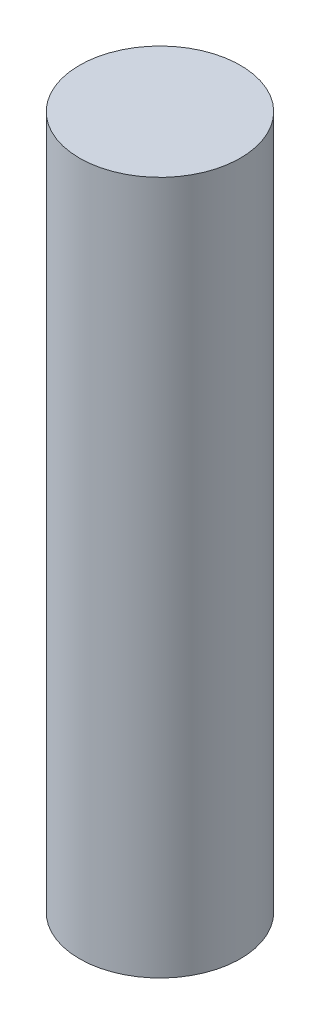
ISO-10303-21;
HEADER;
FILE_DESCRIPTION(('STEP AP214'),'2;1');
FILE_NAME('part.step','',(''),(''),'','','');
FILE_SCHEMA(('AUTOMOTIVE_DESIGN { 1 0 10303 214 1 1 1 1 }'));
ENDSEC;
DATA;
#1=APPLICATION_CONTEXT('core data for automotive mechanical design processes');
#2=APPLICATION_PROTOCOL_DEFINITION('international standard','automotive_design',2000,#1);
#3=PRODUCT_CONTEXT('',#1,'mechanical');
#4=PRODUCT('Part','Part','',(#3));
#5=PRODUCT_RELATED_PRODUCT_CATEGORY('part','',(#4));
#6=PRODUCT_DEFINITION_FORMATION('','',#4);
#7=PRODUCT_DEFINITION_CONTEXT('part definition',#1,'design');
#8=PRODUCT_DEFINITION('design','',#6,#7);
#9=PRODUCT_DEFINITION_SHAPE('','',#8);
#10=(LENGTH_UNIT() NAMED_UNIT(*) SI_UNIT(.MILLI.,.METRE.));
#11=(NAMED_UNIT(*) PLANE_ANGLE_UNIT() SI_UNIT($,.RADIAN.));
#12=(NAMED_UNIT(*) SI_UNIT($,.STERADIAN.) SOLID_ANGLE_UNIT());
#13=UNCERTAINTY_MEASURE_WITH_UNIT(LENGTH_MEASURE(1.E-05),#10,'distance_accuracy_value','');
#14=(GEOMETRIC_REPRESENTATION_CONTEXT(3) GLOBAL_UNCERTAINTY_ASSIGNED_CONTEXT((#13)) GLOBAL_UNIT_ASSIGNED_CONTEXT((#10,
#11,#12)) REPRESENTATION_CONTEXT('',''));
#15=CARTESIAN_POINT('',(0.,0.,0.));
#16=DIRECTION('',(0.,0.,1.));
#17=DIRECTION('',(1.,0.,0.));
#18=AXIS2_PLACEMENT_3D('',#15,#16,#17);
#19=CARTESIAN_POINT('',(0.,86.19,0.));
#20=DIRECTION('',(0.,-1.,0.));
#21=DIRECTION('',(0.,0.,-1.));
#22=AXIS2_PLACEMENT_3D('',#19,#20,#21);
#23=CYLINDRICAL_SURFACE('',#22,10.);
#24=CARTESIAN_POINT('',(0.,86.19,0.));
#25=DIRECTION('',(0.,1.,0.));
#26=DIRECTION('',(0.,0.,1.));
#27=AXIS2_PLACEMENT_3D('',#24,#25,#26);
#28=CIRCLE('',#27,10.);
#29=CARTESIAN_POINT('',(0.,86.19,10.));
#30=VERTEX_POINT('',#29);
#31=EDGE_CURVE('E10',#30,#30,#28,.T.);
#32=ORIENTED_EDGE('',*,*,#31,.F.);
#33=EDGE_LOOP('',(#32));
#34=FACE_BOUND('',#33,.T.);
#35=CARTESIAN_POINT('',(0.,0.,0.));
#36=DIRECTION('',(0.,1.,0.));
#37=DIRECTION('',(0.,0.,1.));
#38=AXIS2_PLACEMENT_3D('',#35,#36,#37);
#39=CIRCLE('',#38,10.);
#40=CARTESIAN_POINT('',(0.,0.,10.));
#41=VERTEX_POINT('',#40);
#42=EDGE_CURVE('E46',#41,#41,#39,.T.);
#43=ORIENTED_EDGE('',*,*,#42,.T.);
#44=EDGE_LOOP('',(#43));
#45=FACE_BOUND('',#44,.T.);
#46=ADVANCED_FACE('F43',(#34,#45),#23,.T.);
#47=CARTESIAN_POINT('',(0.,86.19,0.));
#48=DIRECTION('',(0.,1.,0.));
#49=DIRECTION('',(0.,0.,1.));
#50=AXIS2_PLACEMENT_3D('',#47,#48,#49);
#51=PLANE('',#50);
#52=ORIENTED_EDGE('',*,*,#31,.T.);
#53=EDGE_LOOP('',(#52));
#54=FACE_BOUND('',#53,.T.);
#55=ADVANCED_FACE('F60',(#54),#51,.T.);
#56=CARTESIAN_POINT('',(0.,0.,0.));
#57=DIRECTION('',(0.,1.,0.));
#58=DIRECTION('',(0.,0.,1.));
#59=AXIS2_PLACEMENT_3D('',#56,#57,#58);
#60=PLANE('',#59);
#61=ORIENTED_EDGE('',*,*,#42,.F.);
#62=EDGE_LOOP('',(#61));
#63=FACE_BOUND('',#62,.T.);
#64=ADVANCED_FACE('F58',(#63),#60,.F.);
#65=CLOSED_SHELL('',(#46,#55,#64));
#66=MANIFOLD_SOLID_BREP('B2',#65);
#67=ADVANCED_BREP_SHAPE_REPRESENTATION('',(#18,#66),#14);
#68=SHAPE_DEFINITION_REPRESENTATION(#9,#67);
ENDSEC;
END-ISO-10303-21;
